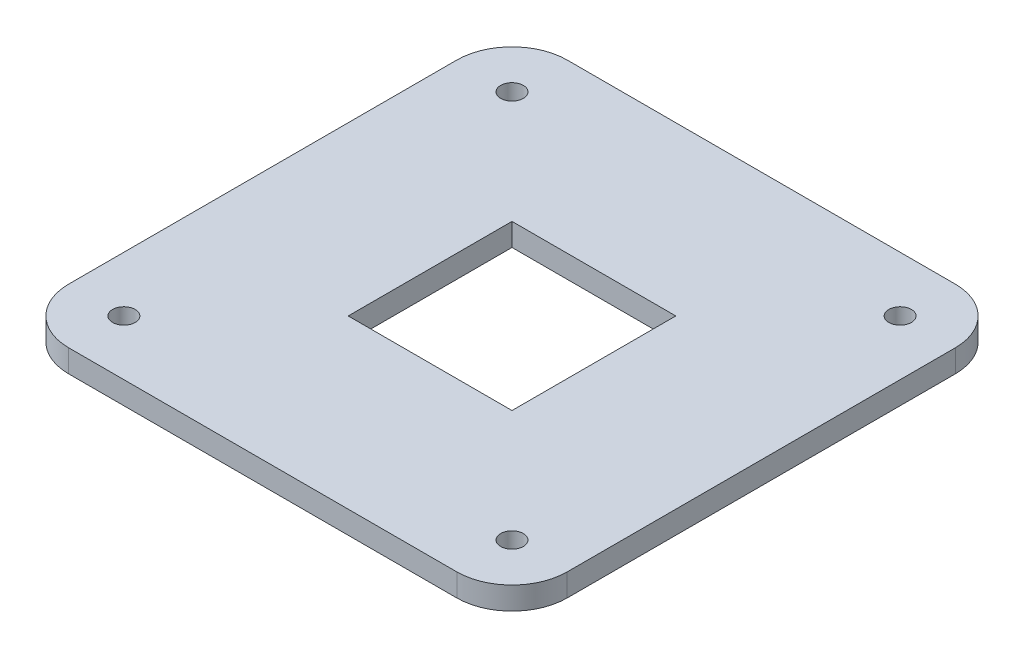
ISO-10303-21;
HEADER;
FILE_DESCRIPTION(('STEP AP214'),'2;1');
FILE_NAME('part.step','',(''),(''),'','','');
FILE_SCHEMA(('AUTOMOTIVE_DESIGN { 1 0 10303 214 1 1 1 1 }'));
ENDSEC;
DATA;
#1=APPLICATION_CONTEXT('core data for automotive mechanical design processes');
#2=APPLICATION_PROTOCOL_DEFINITION('international standard','automotive_design',2000,#1);
#3=PRODUCT_CONTEXT('',#1,'mechanical');
#4=PRODUCT('Part','Part','',(#3));
#5=PRODUCT_RELATED_PRODUCT_CATEGORY('part','',(#4));
#6=PRODUCT_DEFINITION_FORMATION('','',#4);
#7=PRODUCT_DEFINITION_CONTEXT('part definition',#1,'design');
#8=PRODUCT_DEFINITION('design','',#6,#7);
#9=PRODUCT_DEFINITION_SHAPE('','',#8);
#10=(LENGTH_UNIT() NAMED_UNIT(*) SI_UNIT(.MILLI.,.METRE.));
#11=(NAMED_UNIT(*) PLANE_ANGLE_UNIT() SI_UNIT($,.RADIAN.));
#12=(NAMED_UNIT(*) SI_UNIT($,.STERADIAN.) SOLID_ANGLE_UNIT());
#13=UNCERTAINTY_MEASURE_WITH_UNIT(LENGTH_MEASURE(1.E-05),#10,'distance_accuracy_value','');
#14=(GEOMETRIC_REPRESENTATION_CONTEXT(3) GLOBAL_UNCERTAINTY_ASSIGNED_CONTEXT((#13)) GLOBAL_UNIT_ASSIGNED_CONTEXT((#10,
#11,#12)) REPRESENTATION_CONTEXT('',''));
#15=CARTESIAN_POINT('',(0.,0.,0.));
#16=DIRECTION('',(0.,0.,1.));
#17=DIRECTION('',(1.,0.,0.));
#18=AXIS2_PLACEMENT_3D('',#15,#16,#17);
#19=CARTESIAN_POINT('',(-109.,12.7,109.));
#20=DIRECTION('',(0.,1.,0.));
#21=DIRECTION('',(0.,0.,1.));
#22=AXIS2_PLACEMENT_3D('',#19,#20,#21);
#23=PLANE('',#22);
#24=CARTESIAN_POINT('',(109.,12.7,109.));
#25=DIRECTION('',(0.,1.,0.));
#26=DIRECTION('',(0.,0.,1.));
#27=AXIS2_PLACEMENT_3D('',#24,#25,#26);
#28=CIRCLE('',#27,6.34999999999999);
#29=CARTESIAN_POINT('',(109.,12.7,115.35));
#30=VERTEX_POINT('',#29);
#31=EDGE_CURVE('E158',#30,#30,#28,.T.);
#32=ORIENTED_EDGE('',*,*,#31,.F.);
#33=EDGE_LOOP('',(#32));
#34=FACE_BOUND('',#33,.T.);
#35=CARTESIAN_POINT('',(-109.,12.7,-109.));
#36=DIRECTION('',(0.,1.,0.));
#37=DIRECTION('',(0.,0.,1.));
#38=AXIS2_PLACEMENT_3D('',#35,#36,#37);
#39=CIRCLE('',#38,6.34999999999999);
#40=CARTESIAN_POINT('',(-109.,12.7,-102.65));
#41=VERTEX_POINT('',#40);
#42=EDGE_CURVE('E170',#41,#41,#39,.T.);
#43=ORIENTED_EDGE('',*,*,#42,.F.);
#44=EDGE_LOOP('',(#43));
#45=FACE_BOUND('',#44,.T.);
#46=CARTESIAN_POINT('',(-109.,12.7,109.));
#47=DIRECTION('',(0.,1.,0.));
#48=DIRECTION('',(0.,0.,1.));
#49=AXIS2_PLACEMENT_3D('',#46,#47,#48);
#50=CIRCLE('',#49,31.);
#51=CARTESIAN_POINT('',(-140.,12.7,109.));
#52=VERTEX_POINT('',#51);
#53=CARTESIAN_POINT('',(-109.,12.7,140.));
#54=VERTEX_POINT('',#53);
#55=EDGE_CURVE('E182',#52,#54,#50,.T.);
#56=ORIENTED_EDGE('',*,*,#55,.T.);
#57=DIRECTION('',(1.,0.,0.));
#58=VECTOR('',#57,1.);
#59=CARTESIAN_POINT('',(-109.,12.7,140.));
#60=LINE('',#59,#58);
#61=CARTESIAN_POINT('',(109.,12.7,140.));
#62=VERTEX_POINT('',#61);
#63=EDGE_CURVE('E185',#54,#62,#60,.T.);
#64=ORIENTED_EDGE('',*,*,#63,.T.);
#65=CARTESIAN_POINT('',(109.,12.7,109.));
#66=DIRECTION('',(0.,1.,0.));
#67=DIRECTION('',(0.,0.,1.));
#68=AXIS2_PLACEMENT_3D('',#65,#66,#67);
#69=CIRCLE('',#68,31.);
#70=CARTESIAN_POINT('',(140.,12.7,109.));
#71=VERTEX_POINT('',#70);
#72=EDGE_CURVE('E188',#62,#71,#69,.T.);
#73=ORIENTED_EDGE('',*,*,#72,.T.);
#74=DIRECTION('',(0.,0.,-1.));
#75=VECTOR('',#74,1.);
#76=CARTESIAN_POINT('',(140.,12.7,-109.));
#77=LINE('',#76,#75);
#78=CARTESIAN_POINT('',(140.,12.7,-109.));
#79=VERTEX_POINT('',#78);
#80=EDGE_CURVE('E190',#71,#79,#77,.T.);
#81=ORIENTED_EDGE('',*,*,#80,.T.);
#82=CARTESIAN_POINT('',(109.,12.7,-109.));
#83=DIRECTION('',(0.,1.,0.));
#84=DIRECTION('',(0.,0.,-1.));
#85=AXIS2_PLACEMENT_3D('',#82,#83,#84);
#86=CIRCLE('',#85,31.);
#87=CARTESIAN_POINT('',(109.,12.7,-140.));
#88=VERTEX_POINT('',#87);
#89=EDGE_CURVE('E192',#79,#88,#86,.T.);
#90=ORIENTED_EDGE('',*,*,#89,.T.);
#91=DIRECTION('',(-1.,0.,0.));
#92=VECTOR('',#91,1.);
#93=CARTESIAN_POINT('',(-109.,12.7,-140.));
#94=LINE('',#93,#92);
#95=CARTESIAN_POINT('',(-109.,12.7,-140.));
#96=VERTEX_POINT('',#95);
#97=EDGE_CURVE('E194',#88,#96,#94,.T.);
#98=ORIENTED_EDGE('',*,*,#97,.T.);
#99=CARTESIAN_POINT('',(-109.,12.7,-109.));
#100=DIRECTION('',(0.,1.,0.));
#101=DIRECTION('',(0.,0.,1.));
#102=AXIS2_PLACEMENT_3D('',#99,#100,#101);
#103=CIRCLE('',#102,31.);
#104=CARTESIAN_POINT('',(-140.,12.7,-109.));
#105=VERTEX_POINT('',#104);
#106=EDGE_CURVE('E196',#96,#105,#103,.T.);
#107=ORIENTED_EDGE('',*,*,#106,.T.);
#108=DIRECTION('',(0.,0.,1.));
#109=VECTOR('',#108,1.);
#110=CARTESIAN_POINT('',(-140.,12.7,-109.));
#111=LINE('',#110,#109);
#112=EDGE_CURVE('E198',#105,#52,#111,.T.);
#113=ORIENTED_EDGE('',*,*,#112,.T.);
#114=EDGE_LOOP('',(#56,#64,#73,#81,#90,#98,#107,#113));
#115=FACE_BOUND('',#114,.T.);
#116=CARTESIAN_POINT('',(-109.,12.7,109.));
#117=DIRECTION('',(0.,1.,0.));
#118=DIRECTION('',(0.,0.,1.));
#119=AXIS2_PLACEMENT_3D('',#116,#117,#118);
#120=CIRCLE('',#119,6.34999999999999);
#121=CARTESIAN_POINT('',(-109.,12.7,115.35));
#122=VERTEX_POINT('',#121);
#123=EDGE_CURVE('E176',#122,#122,#120,.T.);
#124=ORIENTED_EDGE('',*,*,#123,.F.);
#125=EDGE_LOOP('',(#124));
#126=FACE_BOUND('',#125,.T.);
#127=CARTESIAN_POINT('',(109.,12.7,-109.));
#128=DIRECTION('',(0.,1.,0.));
#129=DIRECTION('',(0.,0.,1.));
#130=AXIS2_PLACEMENT_3D('',#127,#128,#129);
#131=CIRCLE('',#130,6.34999999999999);
#132=CARTESIAN_POINT('',(109.,12.7,-102.65));
#133=VERTEX_POINT('',#132);
#134=EDGE_CURVE('E164',#133,#133,#131,.T.);
#135=ORIENTED_EDGE('',*,*,#134,.F.);
#136=EDGE_LOOP('',(#135));
#137=FACE_BOUND('',#136,.T.);
#138=DIRECTION('',(-1.,0.,0.));
#139=VECTOR('',#138,1.);
#140=CARTESIAN_POINT('',(-46.,12.7,-46.));
#141=LINE('',#140,#139);
#142=CARTESIAN_POINT('',(46.,12.7,-46.));
#143=VERTEX_POINT('',#142);
#144=CARTESIAN_POINT('',(-46.,12.7,-46.));
#145=VERTEX_POINT('',#144);
#146=EDGE_CURVE('E130',#143,#145,#141,.T.);
#147=ORIENTED_EDGE('',*,*,#146,.F.);
#148=DIRECTION('',(0.,0.,-1.));
#149=VECTOR('',#148,1.);
#150=CARTESIAN_POINT('',(46.,12.7,-46.));
#151=LINE('',#150,#149);
#152=CARTESIAN_POINT('',(46.,12.7,46.));
#153=VERTEX_POINT('',#152);
#154=EDGE_CURVE('E122',#153,#143,#151,.T.);
#155=ORIENTED_EDGE('',*,*,#154,.F.);
#156=DIRECTION('',(1.,0.,0.));
#157=VECTOR('',#156,1.);
#158=CARTESIAN_POINT('',(-46.,12.7,46.));
#159=LINE('',#158,#157);
#160=CARTESIAN_POINT('',(-46.,12.7,46.));
#161=VERTEX_POINT('',#160);
#162=EDGE_CURVE('E144',#161,#153,#159,.T.);
#163=ORIENTED_EDGE('',*,*,#162,.F.);
#164=DIRECTION('',(0.,0.,1.));
#165=VECTOR('',#164,1.);
#166=CARTESIAN_POINT('',(-46.,12.7,-46.));
#167=LINE('',#166,#165);
#168=EDGE_CURVE('E142',#145,#161,#167,.T.);
#169=ORIENTED_EDGE('',*,*,#168,.F.);
#170=EDGE_LOOP('',(#147,#155,#163,#169));
#171=FACE_BOUND('',#170,.T.);
#172=ADVANCED_FACE('F33',(#34,#45,#115,#126,#137,#171),#23,.T.);
#173=CARTESIAN_POINT('',(-109.,0.,109.));
#174=DIRECTION('',(0.,1.,0.));
#175=DIRECTION('',(0.,0.,1.));
#176=AXIS2_PLACEMENT_3D('',#173,#174,#175);
#177=PLANE('',#176);
#178=CARTESIAN_POINT('',(109.,0.,109.));
#179=DIRECTION('',(0.,1.,0.));
#180=DIRECTION('',(0.,0.,1.));
#181=AXIS2_PLACEMENT_3D('',#178,#179,#180);
#182=CIRCLE('',#181,6.34999999999999);
#183=CARTESIAN_POINT('',(109.,0.,115.35));
#184=VERTEX_POINT('',#183);
#185=EDGE_CURVE('E138',#184,#184,#182,.T.);
#186=ORIENTED_EDGE('',*,*,#185,.T.);
#187=EDGE_LOOP('',(#186));
#188=FACE_BOUND('',#187,.T.);
#189=CARTESIAN_POINT('',(-109.,0.,-109.));
#190=DIRECTION('',(0.,1.,0.));
#191=DIRECTION('',(0.,0.,1.));
#192=AXIS2_PLACEMENT_3D('',#189,#190,#191);
#193=CIRCLE('',#192,6.34999999999999);
#194=CARTESIAN_POINT('',(-109.,0.,-102.65));
#195=VERTEX_POINT('',#194);
#196=EDGE_CURVE('E167',#195,#195,#193,.T.);
#197=ORIENTED_EDGE('',*,*,#196,.T.);
#198=EDGE_LOOP('',(#197));
#199=FACE_BOUND('',#198,.T.);
#200=CARTESIAN_POINT('',(-109.,0.,109.));
#201=DIRECTION('',(0.,1.,0.));
#202=DIRECTION('',(0.,0.,1.));
#203=AXIS2_PLACEMENT_3D('',#200,#201,#202);
#204=CIRCLE('',#203,31.);
#205=CARTESIAN_POINT('',(-140.,0.,109.));
#206=VERTEX_POINT('',#205);
#207=CARTESIAN_POINT('',(-109.,0.,140.));
#208=VERTEX_POINT('',#207);
#209=EDGE_CURVE('E179',#206,#208,#204,.T.);
#210=ORIENTED_EDGE('',*,*,#209,.F.);
#211=DIRECTION('',(0.,0.,1.));
#212=VECTOR('',#211,1.);
#213=CARTESIAN_POINT('',(-140.,0.,-109.));
#214=LINE('',#213,#212);
#215=CARTESIAN_POINT('',(-140.,0.,-109.));
#216=VERTEX_POINT('',#215);
#217=EDGE_CURVE('E186',#216,#206,#214,.T.);
#218=ORIENTED_EDGE('',*,*,#217,.F.);
#219=CARTESIAN_POINT('',(-109.,0.,-109.));
#220=DIRECTION('',(0.,1.,0.));
#221=DIRECTION('',(0.,0.,1.));
#222=AXIS2_PLACEMENT_3D('',#219,#220,#221);
#223=CIRCLE('',#222,31.);
#224=CARTESIAN_POINT('',(-109.,0.,-140.));
#225=VERTEX_POINT('',#224);
#226=EDGE_CURVE('E213',#225,#216,#223,.T.);
#227=ORIENTED_EDGE('',*,*,#226,.F.);
#228=DIRECTION('',(-1.,0.,0.));
#229=VECTOR('',#228,1.);
#230=CARTESIAN_POINT('',(-109.,0.,-140.));
#231=LINE('',#230,#229);
#232=CARTESIAN_POINT('',(109.,0.,-140.));
#233=VERTEX_POINT('',#232);
#234=EDGE_CURVE('E211',#233,#225,#231,.T.);
#235=ORIENTED_EDGE('',*,*,#234,.F.);
#236=CARTESIAN_POINT('',(109.,0.,-109.));
#237=DIRECTION('',(0.,1.,0.));
#238=DIRECTION('',(0.,0.,-1.));
#239=AXIS2_PLACEMENT_3D('',#236,#237,#238);
#240=CIRCLE('',#239,31.);
#241=CARTESIAN_POINT('',(140.,0.,-109.));
#242=VERTEX_POINT('',#241);
#243=EDGE_CURVE('E209',#242,#233,#240,.T.);
#244=ORIENTED_EDGE('',*,*,#243,.F.);
#245=DIRECTION('',(0.,0.,-1.));
#246=VECTOR('',#245,1.);
#247=CARTESIAN_POINT('',(140.,0.,-109.));
#248=LINE('',#247,#246);
#249=CARTESIAN_POINT('',(140.,0.,109.));
#250=VERTEX_POINT('',#249);
#251=EDGE_CURVE('E207',#250,#242,#248,.T.);
#252=ORIENTED_EDGE('',*,*,#251,.F.);
#253=CARTESIAN_POINT('',(109.,0.,109.));
#254=DIRECTION('',(0.,1.,0.));
#255=DIRECTION('',(0.,0.,1.));
#256=AXIS2_PLACEMENT_3D('',#253,#254,#255);
#257=CIRCLE('',#256,31.);
#258=CARTESIAN_POINT('',(109.,0.,140.));
#259=VERTEX_POINT('',#258);
#260=EDGE_CURVE('E205',#259,#250,#257,.T.);
#261=ORIENTED_EDGE('',*,*,#260,.F.);
#262=DIRECTION('',(1.,0.,0.));
#263=VECTOR('',#262,1.);
#264=CARTESIAN_POINT('',(-109.,0.,140.));
#265=LINE('',#264,#263);
#266=EDGE_CURVE('E203',#208,#259,#265,.T.);
#267=ORIENTED_EDGE('',*,*,#266,.F.);
#268=EDGE_LOOP('',(#210,#218,#227,#235,#244,#252,#261,#267));
#269=FACE_BOUND('',#268,.T.);
#270=CARTESIAN_POINT('',(-109.,0.,109.));
#271=DIRECTION('',(0.,1.,0.));
#272=DIRECTION('',(0.,0.,1.));
#273=AXIS2_PLACEMENT_3D('',#270,#271,#272);
#274=CIRCLE('',#273,6.34999999999999);
#275=CARTESIAN_POINT('',(-109.,0.,115.35));
#276=VERTEX_POINT('',#275);
#277=EDGE_CURVE('E173',#276,#276,#274,.T.);
#278=ORIENTED_EDGE('',*,*,#277,.T.);
#279=EDGE_LOOP('',(#278));
#280=FACE_BOUND('',#279,.T.);
#281=CARTESIAN_POINT('',(109.,0.,-109.));
#282=DIRECTION('',(0.,1.,0.));
#283=DIRECTION('',(0.,0.,1.));
#284=AXIS2_PLACEMENT_3D('',#281,#282,#283);
#285=CIRCLE('',#284,6.34999999999999);
#286=CARTESIAN_POINT('',(109.,0.,-102.65));
#287=VERTEX_POINT('',#286);
#288=EDGE_CURVE('E161',#287,#287,#285,.T.);
#289=ORIENTED_EDGE('',*,*,#288,.T.);
#290=EDGE_LOOP('',(#289));
#291=FACE_BOUND('',#290,.T.);
#292=DIRECTION('',(0.,0.,-1.));
#293=VECTOR('',#292,1.);
#294=CARTESIAN_POINT('',(46.,0.,-46.));
#295=LINE('',#294,#293);
#296=CARTESIAN_POINT('',(46.,0.,46.));
#297=VERTEX_POINT('',#296);
#298=CARTESIAN_POINT('',(46.,0.,-46.));
#299=VERTEX_POINT('',#298);
#300=EDGE_CURVE('E56',#297,#299,#295,.T.);
#301=ORIENTED_EDGE('',*,*,#300,.T.);
#302=DIRECTION('',(-1.,0.,0.));
#303=VECTOR('',#302,1.);
#304=CARTESIAN_POINT('',(-46.,0.,-46.));
#305=LINE('',#304,#303);
#306=CARTESIAN_POINT('',(-46.,0.,-46.));
#307=VERTEX_POINT('',#306);
#308=EDGE_CURVE('E137',#299,#307,#305,.T.);
#309=ORIENTED_EDGE('',*,*,#308,.T.);
#310=DIRECTION('',(0.,0.,1.));
#311=VECTOR('',#310,1.);
#312=CARTESIAN_POINT('',(-46.,0.,-46.));
#313=LINE('',#312,#311);
#314=CARTESIAN_POINT('',(-46.,0.,46.));
#315=VERTEX_POINT('',#314);
#316=EDGE_CURVE('E150',#307,#315,#313,.T.);
#317=ORIENTED_EDGE('',*,*,#316,.T.);
#318=DIRECTION('',(1.,0.,0.));
#319=VECTOR('',#318,1.);
#320=CARTESIAN_POINT('',(-46.,0.,46.));
#321=LINE('',#320,#319);
#322=EDGE_CURVE('E131',#315,#297,#321,.T.);
#323=ORIENTED_EDGE('',*,*,#322,.T.);
#324=EDGE_LOOP('',(#301,#309,#317,#323));
#325=FACE_BOUND('',#324,.T.);
#326=ADVANCED_FACE('F243',(#188,#199,#269,#280,#291,#325),#177,.F.);
#327=CARTESIAN_POINT('',(-109.,12.7,109.));
#328=DIRECTION('',(0.,-1.,0.));
#329=DIRECTION('',(0.,0.,-1.));
#330=AXIS2_PLACEMENT_3D('',#327,#328,#329);
#331=CYLINDRICAL_SURFACE('',#330,31.);
#332=ORIENTED_EDGE('',*,*,#209,.T.);
#333=DIRECTION('',(0.,-1.,0.));
#334=VECTOR('',#333,1.);
#335=CARTESIAN_POINT('',(-109.,12.7,140.));
#336=LINE('',#335,#334);
#337=EDGE_CURVE('E11',#54,#208,#336,.T.);
#338=ORIENTED_EDGE('',*,*,#337,.F.);
#339=ORIENTED_EDGE('',*,*,#55,.F.);
#340=DIRECTION('',(0.,-1.,0.));
#341=VECTOR('',#340,1.);
#342=CARTESIAN_POINT('',(-140.,12.7,109.));
#343=LINE('',#342,#341);
#344=EDGE_CURVE('E200',#52,#206,#343,.T.);
#345=ORIENTED_EDGE('',*,*,#344,.T.);
#346=EDGE_LOOP('',(#332,#338,#339,#345));
#347=FACE_BOUND('',#346,.T.);
#348=ADVANCED_FACE('F35',(#347),#331,.T.);
#349=CARTESIAN_POINT('',(-109.,12.7,140.));
#350=DIRECTION('',(0.,0.,-1.));
#351=DIRECTION('',(-1.,0.,0.));
#352=AXIS2_PLACEMENT_3D('',#349,#350,#351);
#353=PLANE('',#352);
#354=ORIENTED_EDGE('',*,*,#266,.T.);
#355=DIRECTION('',(0.,-1.,0.));
#356=VECTOR('',#355,1.);
#357=CARTESIAN_POINT('',(109.,12.7,140.));
#358=LINE('',#357,#356);
#359=EDGE_CURVE('E41',#62,#259,#358,.T.);
#360=ORIENTED_EDGE('',*,*,#359,.F.);
#361=ORIENTED_EDGE('',*,*,#63,.F.);
#362=ORIENTED_EDGE('',*,*,#337,.T.);
#363=EDGE_LOOP('',(#354,#360,#361,#362));
#364=FACE_BOUND('',#363,.T.);
#365=ADVANCED_FACE('F261',(#364),#353,.F.);
#366=CARTESIAN_POINT('',(109.,12.7,109.));
#367=DIRECTION('',(0.,-1.,0.));
#368=DIRECTION('',(0.,0.,-1.));
#369=AXIS2_PLACEMENT_3D('',#366,#367,#368);
#370=CYLINDRICAL_SURFACE('',#369,31.);
#371=ORIENTED_EDGE('',*,*,#260,.T.);
#372=DIRECTION('',(0.,-1.,0.));
#373=VECTOR('',#372,1.);
#374=CARTESIAN_POINT('',(140.,12.7,109.));
#375=LINE('',#374,#373);
#376=EDGE_CURVE('E230',#71,#250,#375,.T.);
#377=ORIENTED_EDGE('',*,*,#376,.F.);
#378=ORIENTED_EDGE('',*,*,#72,.F.);
#379=ORIENTED_EDGE('',*,*,#359,.T.);
#380=EDGE_LOOP('',(#371,#377,#378,#379));
#381=FACE_BOUND('',#380,.T.);
#382=ADVANCED_FACE('F237',(#381),#370,.T.);
#383=CARTESIAN_POINT('',(140.,12.7,-109.));
#384=DIRECTION('',(-1.,0.,0.));
#385=DIRECTION('',(0.,0.,1.));
#386=AXIS2_PLACEMENT_3D('',#383,#384,#385);
#387=PLANE('',#386);
#388=ORIENTED_EDGE('',*,*,#251,.T.);
#389=DIRECTION('',(0.,-1.,0.));
#390=VECTOR('',#389,1.);
#391=CARTESIAN_POINT('',(140.,12.7,-109.));
#392=LINE('',#391,#390);
#393=EDGE_CURVE('E227',#79,#242,#392,.T.);
#394=ORIENTED_EDGE('',*,*,#393,.F.);
#395=ORIENTED_EDGE('',*,*,#80,.F.);
#396=ORIENTED_EDGE('',*,*,#376,.T.);
#397=EDGE_LOOP('',(#388,#394,#395,#396));
#398=FACE_BOUND('',#397,.T.);
#399=ADVANCED_FACE('F249',(#398),#387,.F.);
#400=CARTESIAN_POINT('',(109.,12.7,-109.));
#401=DIRECTION('',(0.,-1.,0.));
#402=DIRECTION('',(0.,0.,-1.));
#403=AXIS2_PLACEMENT_3D('',#400,#401,#402);
#404=CYLINDRICAL_SURFACE('',#403,31.);
#405=ORIENTED_EDGE('',*,*,#243,.T.);
#406=DIRECTION('',(0.,-1.,0.));
#407=VECTOR('',#406,1.);
#408=CARTESIAN_POINT('',(109.,12.7,-140.));
#409=LINE('',#408,#407);
#410=EDGE_CURVE('E224',#88,#233,#409,.T.);
#411=ORIENTED_EDGE('',*,*,#410,.F.);
#412=ORIENTED_EDGE('',*,*,#89,.F.);
#413=ORIENTED_EDGE('',*,*,#393,.T.);
#414=EDGE_LOOP('',(#405,#411,#412,#413));
#415=FACE_BOUND('',#414,.T.);
#416=ADVANCED_FACE('F253',(#415),#404,.T.);
#417=CARTESIAN_POINT('',(-109.,12.7,-140.));
#418=DIRECTION('',(0.,0.,1.));
#419=DIRECTION('',(1.,0.,0.));
#420=AXIS2_PLACEMENT_3D('',#417,#418,#419);
#421=PLANE('',#420);
#422=ORIENTED_EDGE('',*,*,#234,.T.);
#423=DIRECTION('',(0.,-1.,0.));
#424=VECTOR('',#423,1.);
#425=CARTESIAN_POINT('',(-109.,12.7,-140.));
#426=LINE('',#425,#424);
#427=EDGE_CURVE('E221',#96,#225,#426,.T.);
#428=ORIENTED_EDGE('',*,*,#427,.F.);
#429=ORIENTED_EDGE('',*,*,#97,.F.);
#430=ORIENTED_EDGE('',*,*,#410,.T.);
#431=EDGE_LOOP('',(#422,#428,#429,#430));
#432=FACE_BOUND('',#431,.T.);
#433=ADVANCED_FACE('F274',(#432),#421,.F.);
#434=CARTESIAN_POINT('',(-109.,12.7,-109.));
#435=DIRECTION('',(0.,-1.,0.));
#436=DIRECTION('',(0.,0.,-1.));
#437=AXIS2_PLACEMENT_3D('',#434,#435,#436);
#438=CYLINDRICAL_SURFACE('',#437,31.);
#439=ORIENTED_EDGE('',*,*,#226,.T.);
#440=DIRECTION('',(0.,-1.,0.));
#441=VECTOR('',#440,1.);
#442=CARTESIAN_POINT('',(-140.,12.7,-109.));
#443=LINE('',#442,#441);
#444=EDGE_CURVE('E218',#105,#216,#443,.T.);
#445=ORIENTED_EDGE('',*,*,#444,.F.);
#446=ORIENTED_EDGE('',*,*,#106,.F.);
#447=ORIENTED_EDGE('',*,*,#427,.T.);
#448=EDGE_LOOP('',(#439,#445,#446,#447));
#449=FACE_BOUND('',#448,.T.);
#450=ADVANCED_FACE('F272',(#449),#438,.T.);
#451=CARTESIAN_POINT('',(-140.,12.7,-109.));
#452=DIRECTION('',(1.,0.,0.));
#453=DIRECTION('',(0.,0.,-1.));
#454=AXIS2_PLACEMENT_3D('',#451,#452,#453);
#455=PLANE('',#454);
#456=ORIENTED_EDGE('',*,*,#217,.T.);
#457=ORIENTED_EDGE('',*,*,#344,.F.);
#458=ORIENTED_EDGE('',*,*,#112,.F.);
#459=ORIENTED_EDGE('',*,*,#444,.T.);
#460=EDGE_LOOP('',(#456,#457,#458,#459));
#461=FACE_BOUND('',#460,.T.);
#462=ADVANCED_FACE('F267',(#461),#455,.F.);
#463=CARTESIAN_POINT('',(-109.,12.7,109.));
#464=DIRECTION('',(0.,-1.,0.));
#465=DIRECTION('',(0.,0.,-1.));
#466=AXIS2_PLACEMENT_3D('',#463,#464,#465);
#467=CYLINDRICAL_SURFACE('',#466,6.34999999999999);
#468=ORIENTED_EDGE('',*,*,#123,.T.);
#469=EDGE_LOOP('',(#468));
#470=FACE_BOUND('',#469,.T.);
#471=ORIENTED_EDGE('',*,*,#277,.F.);
#472=EDGE_LOOP('',(#471));
#473=FACE_BOUND('',#472,.T.);
#474=ADVANCED_FACE('F294',(#470,#473),#467,.F.);
#475=CARTESIAN_POINT('',(-109.,12.7,-109.));
#476=DIRECTION('',(0.,-1.,0.));
#477=DIRECTION('',(0.,0.,-1.));
#478=AXIS2_PLACEMENT_3D('',#475,#476,#477);
#479=CYLINDRICAL_SURFACE('',#478,6.34999999999999);
#480=ORIENTED_EDGE('',*,*,#42,.T.);
#481=EDGE_LOOP('',(#480));
#482=FACE_BOUND('',#481,.T.);
#483=ORIENTED_EDGE('',*,*,#196,.F.);
#484=EDGE_LOOP('',(#483));
#485=FACE_BOUND('',#484,.T.);
#486=ADVANCED_FACE('F301',(#482,#485),#479,.F.);
#487=CARTESIAN_POINT('',(109.,12.7,-109.));
#488=DIRECTION('',(0.,-1.,0.));
#489=DIRECTION('',(0.,0.,-1.));
#490=AXIS2_PLACEMENT_3D('',#487,#488,#489);
#491=CYLINDRICAL_SURFACE('',#490,6.34999999999999);
#492=ORIENTED_EDGE('',*,*,#134,.T.);
#493=EDGE_LOOP('',(#492));
#494=FACE_BOUND('',#493,.T.);
#495=ORIENTED_EDGE('',*,*,#288,.F.);
#496=EDGE_LOOP('',(#495));
#497=FACE_BOUND('',#496,.T.);
#498=ADVANCED_FACE('F306',(#494,#497),#491,.F.);
#499=CARTESIAN_POINT('',(109.,12.7,109.));
#500=DIRECTION('',(0.,-1.,0.));
#501=DIRECTION('',(0.,0.,-1.));
#502=AXIS2_PLACEMENT_3D('',#499,#500,#501);
#503=CYLINDRICAL_SURFACE('',#502,6.34999999999999);
#504=ORIENTED_EDGE('',*,*,#31,.T.);
#505=EDGE_LOOP('',(#504));
#506=FACE_BOUND('',#505,.T.);
#507=ORIENTED_EDGE('',*,*,#185,.F.);
#508=EDGE_LOOP('',(#507));
#509=FACE_BOUND('',#508,.T.);
#510=ADVANCED_FACE('F329',(#506,#509),#503,.F.);
#511=CARTESIAN_POINT('',(46.,12.7,-46.));
#512=DIRECTION('',(-1.,0.,0.));
#513=DIRECTION('',(0.,0.,1.));
#514=AXIS2_PLACEMENT_3D('',#511,#512,#513);
#515=PLANE('',#514);
#516=ORIENTED_EDGE('',*,*,#300,.F.);
#517=DIRECTION('',(0.,-1.,0.));
#518=VECTOR('',#517,1.);
#519=CARTESIAN_POINT('',(46.,12.7,46.));
#520=LINE('',#519,#518);
#521=EDGE_CURVE('E126',#153,#297,#520,.T.);
#522=ORIENTED_EDGE('',*,*,#521,.F.);
#523=ORIENTED_EDGE('',*,*,#154,.T.);
#524=DIRECTION('',(0.,-1.,0.));
#525=VECTOR('',#524,1.);
#526=CARTESIAN_POINT('',(46.,12.7,-46.));
#527=LINE('',#526,#525);
#528=EDGE_CURVE('E125',#143,#299,#527,.T.);
#529=ORIENTED_EDGE('',*,*,#528,.T.);
#530=EDGE_LOOP('',(#516,#522,#523,#529));
#531=FACE_BOUND('',#530,.T.);
#532=ADVANCED_FACE('F124',(#531),#515,.T.);
#533=CARTESIAN_POINT('',(-46.,12.7,-46.));
#534=DIRECTION('',(0.,0.,1.));
#535=DIRECTION('',(1.,0.,0.));
#536=AXIS2_PLACEMENT_3D('',#533,#534,#535);
#537=PLANE('',#536);
#538=ORIENTED_EDGE('',*,*,#308,.F.);
#539=ORIENTED_EDGE('',*,*,#528,.F.);
#540=ORIENTED_EDGE('',*,*,#146,.T.);
#541=DIRECTION('',(0.,-1.,0.));
#542=VECTOR('',#541,1.);
#543=CARTESIAN_POINT('',(-46.,12.7,-46.));
#544=LINE('',#543,#542);
#545=EDGE_CURVE('E139',#145,#307,#544,.T.);
#546=ORIENTED_EDGE('',*,*,#545,.T.);
#547=EDGE_LOOP('',(#538,#539,#540,#546));
#548=FACE_BOUND('',#547,.T.);
#549=ADVANCED_FACE('F134',(#548),#537,.T.);
#550=CARTESIAN_POINT('',(-46.,12.7,-46.));
#551=DIRECTION('',(1.,0.,0.));
#552=DIRECTION('',(0.,0.,-1.));
#553=AXIS2_PLACEMENT_3D('',#550,#551,#552);
#554=PLANE('',#553);
#555=ORIENTED_EDGE('',*,*,#316,.F.);
#556=ORIENTED_EDGE('',*,*,#545,.F.);
#557=ORIENTED_EDGE('',*,*,#168,.T.);
#558=DIRECTION('',(0.,-1.,0.));
#559=VECTOR('',#558,1.);
#560=CARTESIAN_POINT('',(-46.,12.7,46.));
#561=LINE('',#560,#559);
#562=EDGE_CURVE('E48',#161,#315,#561,.T.);
#563=ORIENTED_EDGE('',*,*,#562,.T.);
#564=EDGE_LOOP('',(#555,#556,#557,#563));
#565=FACE_BOUND('',#564,.T.);
#566=ADVANCED_FACE('F317',(#565),#554,.T.);
#567=CARTESIAN_POINT('',(-46.,12.7,46.));
#568=DIRECTION('',(0.,0.,-1.));
#569=DIRECTION('',(-1.,0.,0.));
#570=AXIS2_PLACEMENT_3D('',#567,#568,#569);
#571=PLANE('',#570);
#572=ORIENTED_EDGE('',*,*,#322,.F.);
#573=ORIENTED_EDGE('',*,*,#562,.F.);
#574=ORIENTED_EDGE('',*,*,#162,.T.);
#575=ORIENTED_EDGE('',*,*,#521,.T.);
#576=EDGE_LOOP('',(#572,#573,#574,#575));
#577=FACE_BOUND('',#576,.T.);
#578=ADVANCED_FACE('F315',(#577),#571,.T.);
#579=CLOSED_SHELL('',(#172,#326,#348,#365,#382,#399,#416,#433,#450,#462,#474,#486,#498,#510,
#532,#549,#566,#578));
#580=MANIFOLD_SOLID_BREP('B2',#579);
#581=ADVANCED_BREP_SHAPE_REPRESENTATION('',(#18,#580),#14);
#582=SHAPE_DEFINITION_REPRESENTATION(#9,#581);
ENDSEC;
END-ISO-10303-21;
